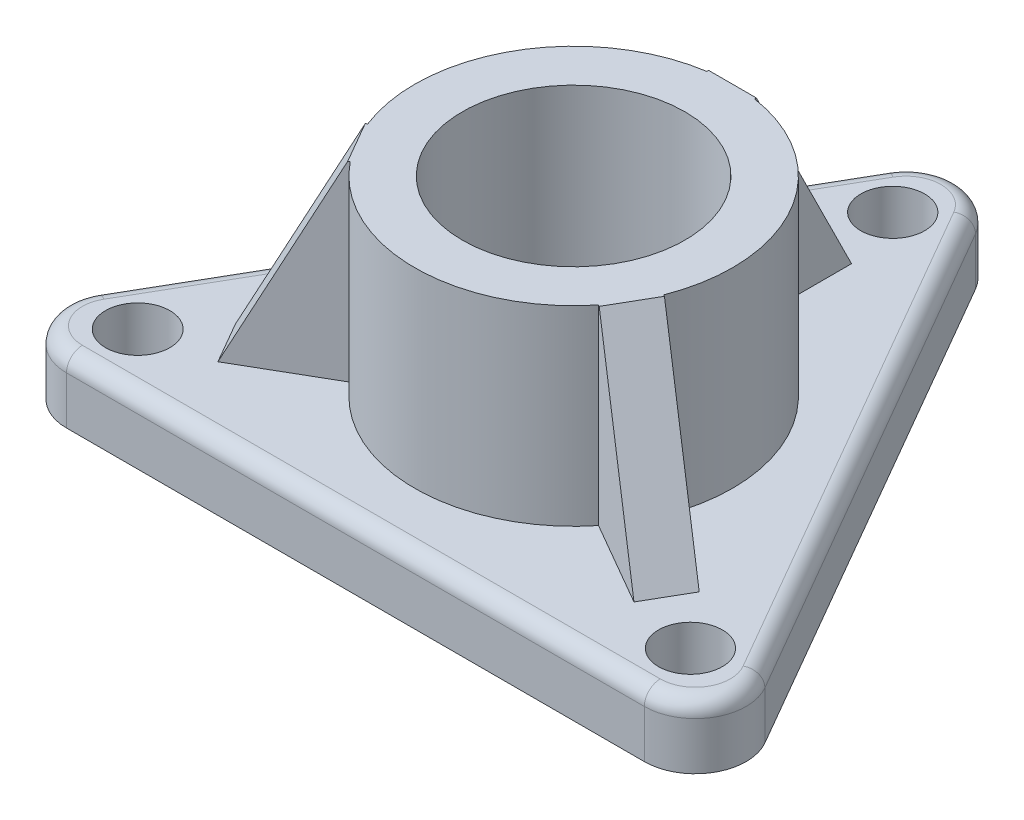
ISO-10303-21;
HEADER;
FILE_DESCRIPTION(('STEP AP214'),'2;1');
FILE_NAME('part.step','',(''),(''),'','','');
FILE_SCHEMA(('AUTOMOTIVE_DESIGN { 1 0 10303 214 1 1 1 1 }'));
ENDSEC;
DATA;
#1=APPLICATION_CONTEXT('core data for automotive mechanical design processes');
#2=APPLICATION_PROTOCOL_DEFINITION('international standard','automotive_design',2000,#1);
#3=PRODUCT_CONTEXT('',#1,'mechanical');
#4=PRODUCT('Part','Part','',(#3));
#5=PRODUCT_RELATED_PRODUCT_CATEGORY('part','',(#4));
#6=PRODUCT_DEFINITION_FORMATION('','',#4);
#7=PRODUCT_DEFINITION_CONTEXT('part definition',#1,'design');
#8=PRODUCT_DEFINITION('design','',#6,#7);
#9=PRODUCT_DEFINITION_SHAPE('','',#8);
#10=(LENGTH_UNIT() NAMED_UNIT(*) SI_UNIT(.MILLI.,.METRE.));
#11=(NAMED_UNIT(*) PLANE_ANGLE_UNIT() SI_UNIT($,.RADIAN.));
#12=(NAMED_UNIT(*) SI_UNIT($,.STERADIAN.) SOLID_ANGLE_UNIT());
#13=UNCERTAINTY_MEASURE_WITH_UNIT(LENGTH_MEASURE(1.E-05),#10,'distance_accuracy_value','');
#14=(GEOMETRIC_REPRESENTATION_CONTEXT(3) GLOBAL_UNCERTAINTY_ASSIGNED_CONTEXT((#13)) GLOBAL_UNIT_ASSIGNED_CONTEXT((#10,
#11,#12)) REPRESENTATION_CONTEXT('',''));
#15=CARTESIAN_POINT('',(0.,0.,0.));
#16=DIRECTION('',(0.,0.,1.));
#17=DIRECTION('',(1.,0.,0.));
#18=AXIS2_PLACEMENT_3D('',#15,#16,#17);
#19=CARTESIAN_POINT('',(0.,50.8,0.));
#20=DIRECTION('',(0.,-1.,0.));
#21=DIRECTION('',(0.,0.,-1.));
#22=AXIS2_PLACEMENT_3D('',#19,#20,#21);
#23=CYLINDRICAL_SURFACE('',#22,31.6964415141576);
#24=DIRECTION('',(0.,-1.,0.));
#25=VECTOR('',#24,1.);
#26=CARTESIAN_POINT('',(4.76249999999957,50.8,-31.3366079595482));
#27=LINE('',#26,#25);
#28=CARTESIAN_POINT('',(4.76249999999957,50.8,-31.3366079595482));
#29=VERTEX_POINT('',#28);
#30=CARTESIAN_POINT('',(4.76249999999957,12.7,-31.3366079595482));
#31=VERTEX_POINT('',#30);
#32=EDGE_CURVE('E197',#29,#31,#27,.T.);
#33=ORIENTED_EDGE('',*,*,#32,.F.);
#34=CARTESIAN_POINT('',(0.,50.8,0.));
#35=DIRECTION('',(0.,1.,0.));
#36=DIRECTION('',(0.,0.,1.));
#37=AXIS2_PLACEMENT_3D('',#34,#35,#36);
#38=CIRCLE('',#37,31.6964415141576);
#39=CARTESIAN_POINT('',(29.5195485614024,50.8,11.5438579942504));
#40=VERTEX_POINT('',#39);
#41=EDGE_CURVE('E314',#40,#29,#38,.T.);
#42=ORIENTED_EDGE('',*,*,#41,.F.);
#43=DIRECTION('',(0.,-1.,0.));
#44=VECTOR('',#43,1.);
#45=CARTESIAN_POINT('',(29.5195485614024,50.8,11.5438579942504));
#46=LINE('',#45,#44);
#47=CARTESIAN_POINT('',(29.5195485614024,12.7,11.5438579942504));
#48=VERTEX_POINT('',#47);
#49=EDGE_CURVE('E258',#40,#48,#46,.T.);
#50=ORIENTED_EDGE('',*,*,#49,.T.);
#51=CARTESIAN_POINT('',(0.,12.7,0.));
#52=DIRECTION('',(0.,1.,0.));
#53=DIRECTION('',(0.,0.,1.));
#54=AXIS2_PLACEMENT_3D('',#51,#52,#53);
#55=CIRCLE('',#54,31.6964415141576);
#56=EDGE_CURVE('E319',#48,#31,#55,.T.);
#57=ORIENTED_EDGE('',*,*,#56,.T.);
#58=EDGE_LOOP('',(#33,#42,#50,#57));
#59=FACE_BOUND('',#58,.T.);
#60=ADVANCED_FACE('F39',(#59),#23,.T.);
#61=DIRECTION('',(0.,-1.,0.));
#62=VECTOR('',#61,1.);
#63=CARTESIAN_POINT('',(24.7570485614025,50.8,19.7927499652972));
#64=LINE('',#63,#62);
#65=CARTESIAN_POINT('',(24.7570485614025,50.8,19.7927499652972));
#66=VERTEX_POINT('',#65);
#67=CARTESIAN_POINT('',(24.7570485614025,12.7,19.7927499652972));
#68=VERTEX_POINT('',#67);
#69=EDGE_CURVE('E248',#66,#68,#64,.T.);
#70=ORIENTED_EDGE('',*,*,#69,.F.);
#71=CARTESIAN_POINT('',(-24.7570485614022,50.8,19.7927499652976));
#72=VERTEX_POINT('',#71);
#73=EDGE_CURVE('E309',#72,#66,#38,.T.);
#74=ORIENTED_EDGE('',*,*,#73,.F.);
#75=DIRECTION('',(0.,-1.,0.));
#76=VECTOR('',#75,1.);
#77=CARTESIAN_POINT('',(-24.7570485614022,50.8,19.7927499652976));
#78=LINE('',#77,#76);
#79=CARTESIAN_POINT('',(-24.7570485614022,12.7,19.7927499652976));
#80=VERTEX_POINT('',#79);
#81=EDGE_CURVE('E273',#72,#80,#78,.T.);
#82=ORIENTED_EDGE('',*,*,#81,.T.);
#83=EDGE_CURVE('E316',#80,#68,#55,.T.);
#84=ORIENTED_EDGE('',*,*,#83,.T.);
#85=EDGE_LOOP('',(#70,#74,#82,#84));
#86=FACE_BOUND('',#85,.T.);
#87=ADVANCED_FACE('F502',(#86),#23,.T.);
#88=CARTESIAN_POINT('',(0.,12.7,0.));
#89=DIRECTION('',(0.,1.,0.));
#90=DIRECTION('',(0.,0.,1.));
#91=AXIS2_PLACEMENT_3D('',#88,#89,#90);
#92=PLANE('',#91);
#93=DIRECTION('',(0.,0.,1.));
#94=VECTOR('',#93,1.);
#95=CARTESIAN_POINT('',(-4.76249999999999,12.7,0.));
#96=LINE('',#95,#94);
#97=CARTESIAN_POINT('',(-4.7625000000007,12.7,-50.6555311390038));
#98=VERTEX_POINT('',#97);
#99=CARTESIAN_POINT('',(-4.76250000000043,12.7,-31.3366079595481));
#100=VERTEX_POINT('',#99);
#101=EDGE_CURVE('E57',#98,#100,#96,.T.);
#102=ORIENTED_EDGE('',*,*,#101,.F.);
#103=DIRECTION('',(1.,0.,0.));
#104=VECTOR('',#103,1.);
#105=CARTESIAN_POINT('',(-4.7625000000007,12.7,-50.6555311390038));
#106=LINE('',#105,#104);
#107=CARTESIAN_POINT('',(4.7624999999993,12.7,-50.6555311389984));
#108=VERTEX_POINT('',#107);
#109=EDGE_CURVE('E61',#98,#108,#106,.T.);
#110=ORIENTED_EDGE('',*,*,#109,.T.);
#111=DIRECTION('',(0.,0.,1.));
#112=VECTOR('',#111,1.);
#113=CARTESIAN_POINT('',(4.76250000000001,12.7,0.));
#114=LINE('',#113,#112);
#115=EDGE_CURVE('E221',#108,#31,#114,.T.);
#116=ORIENTED_EDGE('',*,*,#115,.T.);
#117=ORIENTED_EDGE('',*,*,#56,.F.);
#118=DIRECTION('',(-0.866025403784443,0.,-0.499999999999992));
#119=VECTOR('',#118,1.);
#120=CARTESIAN_POINT('',(2.38124999999996,12.7,-4.1244459855234));
#121=LINE('',#120,#119);
#122=CARTESIAN_POINT('',(46.2502268085712,12.7,21.2033195839781));
#123=VERTEX_POINT('',#122);
#124=EDGE_CURVE('E261',#123,#48,#121,.T.);
#125=ORIENTED_EDGE('',*,*,#124,.F.);
#126=DIRECTION('',(-0.499999999999992,0.,0.866025403784443));
#127=VECTOR('',#126,1.);
#128=CARTESIAN_POINT('',(46.2502268085712,12.7,21.2033195839781));
#129=LINE('',#128,#127);
#130=CARTESIAN_POINT('',(41.4877268085665,12.7,29.4522115550222));
#131=VERTEX_POINT('',#130);
#132=EDGE_CURVE('E238',#123,#131,#129,.T.);
#133=ORIENTED_EDGE('',*,*,#132,.T.);
#134=DIRECTION('',(-0.866025403784443,0.,-0.499999999999992));
#135=VECTOR('',#134,1.);
#136=CARTESIAN_POINT('',(-2.38124999999997,12.7,4.12444598552342));
#137=LINE('',#136,#135);
#138=EDGE_CURVE('E254',#131,#68,#137,.T.);
#139=ORIENTED_EDGE('',*,*,#138,.T.);
#140=ORIENTED_EDGE('',*,*,#83,.F.);
#141=DIRECTION('',(0.866025403784436,0.,-0.500000000000004));
#142=VECTOR('',#141,1.);
#143=CARTESIAN_POINT('',(2.38125000000002,12.7,4.12444598552337));
#144=LINE('',#143,#142);
#145=CARTESIAN_POINT('',(-41.4877268085709,12.7,29.4522115550255));
#146=VERTEX_POINT('',#145);
#147=EDGE_CURVE('E277',#146,#80,#144,.T.);
#148=ORIENTED_EDGE('',*,*,#147,.F.);
#149=DIRECTION('',(0.500000000000004,0.,0.866025403784436));
#150=VECTOR('',#149,1.);
#151=CARTESIAN_POINT('',(-46.2502268085709,12.7,21.2033195839787));
#152=LINE('',#151,#150);
#153=CARTESIAN_POINT('',(-46.2502268085709,12.7,21.2033195839787));
#154=VERTEX_POINT('',#153);
#155=EDGE_CURVE('E293',#154,#146,#152,.T.);
#156=ORIENTED_EDGE('',*,*,#155,.F.);
#157=DIRECTION('',(-0.866025403784436,0.,0.500000000000004));
#158=VECTOR('',#157,1.);
#159=CARTESIAN_POINT('',(-26.687894357597,12.7,9.90900167743188));
#160=LINE('',#159,#158);
#161=CARTESIAN_POINT('',(-29.5195485614023,12.7,11.5438579942508));
#162=VERTEX_POINT('',#161);
#163=EDGE_CURVE('E280',#162,#154,#160,.T.);
#164=ORIENTED_EDGE('',*,*,#163,.F.);
#165=EDGE_CURVE('E305',#100,#162,#55,.T.);
#166=ORIENTED_EDGE('',*,*,#165,.F.);
#167=EDGE_LOOP('',(#102,#110,#116,#117,#125,#133,#139,#140,#148,#156,#164,#166));
#168=FACE_BOUND('',#167,.T.);
#169=DIRECTION('',(-0.500000000000004,0.,-0.866025403784436));
#170=VECTOR('',#169,1.);
#171=CARTESIAN_POINT('',(6.04918744543435,12.7,-69.7644196864919));
#172=LINE('',#171,#170);
#173=CARTESIAN_POINT('',(63.4423534514986,12.7,29.6434598432453));
#174=VERTEX_POINT('',#173);
#175=CARTESIAN_POINT('',(6.04918744543436,12.7,-69.7644196864919));
#176=VERTEX_POINT('',#175);
#177=EDGE_CURVE('E398',#174,#176,#172,.T.);
#178=ORIENTED_EDGE('',*,*,#177,.T.);
#179=CARTESIAN_POINT('',(0.,12.7,-66.2719196864918));
#180=DIRECTION('',(0.,1.,0.));
#181=DIRECTION('',(0.,0.,1.));
#182=AXIS2_PLACEMENT_3D('',#179,#180,#181);
#183=CIRCLE('',#182,6.985);
#184=CARTESIAN_POINT('',(-6.04918744543424,12.7,-69.7644196864918));
#185=VERTEX_POINT('',#184);
#186=EDGE_CURVE('E401',#176,#185,#183,.T.);
#187=ORIENTED_EDGE('',*,*,#186,.T.);
#188=DIRECTION('',(-0.499999999999998,0.,0.86602540378444));
#189=VECTOR('',#188,1.);
#190=CARTESIAN_POINT('',(-63.6623239040593,12.7,30.0244598432462));
#191=LINE('',#190,#189);
#192=CARTESIAN_POINT('',(-63.6623239040593,12.7,30.0244598432462));
#193=VERTEX_POINT('',#192);
#194=EDGE_CURVE('E395',#185,#193,#191,.T.);
#195=ORIENTED_EDGE('',*,*,#194,.T.);
#196=CARTESIAN_POINT('',(-57.8331069111862,12.7,33.3899598432461));
#197=DIRECTION('',(0.,1.,0.));
#198=DIRECTION('',(0.,0.,1.));
#199=AXIS2_PLACEMENT_3D('',#196,#197,#198);
#200=CIRCLE('',#199,6.731);
#201=CARTESIAN_POINT('',(-57.8331069111862,12.7,40.1209598432461));
#202=VERTEX_POINT('',#201);
#203=EDGE_CURVE('E392',#193,#202,#200,.T.);
#204=ORIENTED_EDGE('',*,*,#203,.T.);
#205=DIRECTION('',(1.,0.,0.));
#206=VECTOR('',#205,1.);
#207=CARTESIAN_POINT('',(57.3931660060643,12.7,40.1209598432453));
#208=LINE('',#207,#206);
#209=CARTESIAN_POINT('',(57.3931660060643,12.7,40.1209598432453));
#210=VERTEX_POINT('',#209);
#211=EDGE_CURVE('E389',#202,#210,#208,.T.);
#212=ORIENTED_EDGE('',*,*,#211,.T.);
#213=CARTESIAN_POINT('',(57.3931660060643,12.7,33.1359598432453));
#214=DIRECTION('',(0.,1.,0.));
#215=DIRECTION('',(0.,0.,1.));
#216=AXIS2_PLACEMENT_3D('',#213,#214,#215);
#217=CIRCLE('',#216,6.985);
#218=EDGE_CURVE('E386',#210,#174,#217,.T.);
#219=ORIENTED_EDGE('',*,*,#218,.T.);
#220=EDGE_LOOP('',(#178,#187,#195,#204,#212,#219));
#221=FACE_BOUND('',#220,.T.);
#222=CARTESIAN_POINT('',(55.1128235736849,12.7,31.8194035260667));
#223=DIRECTION('',(0.,1.,0.));
#224=DIRECTION('',(0.,0.,1.));
#225=AXIS2_PLACEMENT_3D('',#222,#223,#224);
#226=CIRCLE('',#225,6.3644014156127);
#227=CARTESIAN_POINT('',(55.1128235736849,12.7,38.1838049416794));
#228=VERTEX_POINT('',#227);
#229=EDGE_CURVE('E329',#228,#228,#226,.T.);
#230=ORIENTED_EDGE('',*,*,#229,.F.);
#231=EDGE_LOOP('',(#230));
#232=FACE_BOUND('',#231,.T.);
#233=CARTESIAN_POINT('',(3.80888941584997E-12,12.7,-63.6388070520337));
#234=DIRECTION('',(0.,1.,0.));
#235=DIRECTION('',(0.,0.,1.));
#236=AXIS2_PLACEMENT_3D('',#233,#234,#235);
#237=CIRCLE('',#236,6.36947411317297);
#238=CARTESIAN_POINT('',(3.80888941584997E-12,12.7,-57.2693329388607));
#239=VERTEX_POINT('',#238);
#240=EDGE_CURVE('E337',#239,#239,#237,.T.);
#241=ORIENTED_EDGE('',*,*,#240,.F.);
#242=EDGE_LOOP('',(#241));
#243=FACE_BOUND('',#242,.T.);
#244=CARTESIAN_POINT('',(-55.1128235735971,12.7,31.819403526017));
#245=DIRECTION('',(0.,1.,0.));
#246=DIRECTION('',(0.,0.,1.));
#247=AXIS2_PLACEMENT_3D('',#244,#245,#246);
#248=CIRCLE('',#247,6.41322557330258);
#249=CARTESIAN_POINT('',(-55.1128235735971,12.7,38.2326290993196));
#250=VERTEX_POINT('',#249);
#251=EDGE_CURVE('E320',#250,#250,#248,.T.);
#252=ORIENTED_EDGE('',*,*,#251,.F.);
#253=EDGE_LOOP('',(#252));
#254=FACE_BOUND('',#253,.T.);
#255=ADVANCED_FACE('F491',(#168,#221,#232,#243,#254),#92,.T.);
#256=CARTESIAN_POINT('',(-4.76250000000043,50.8,-31.3366079595481));
#257=VERTEX_POINT('',#256);
#258=CARTESIAN_POINT('',(-29.5195485614023,50.8,11.5438579942508));
#259=VERTEX_POINT('',#258);
#260=EDGE_CURVE('E315',#257,#259,#38,.T.);
#261=ORIENTED_EDGE('',*,*,#260,.F.);
#262=DIRECTION('',(0.,-1.,0.));
#263=VECTOR('',#262,1.);
#264=CARTESIAN_POINT('',(-4.76250000000043,50.8,-31.336607959548));
#265=LINE('',#264,#263);
#266=EDGE_CURVE('E204',#257,#100,#265,.T.);
#267=ORIENTED_EDGE('',*,*,#266,.T.);
#268=ORIENTED_EDGE('',*,*,#165,.T.);
#269=DIRECTION('',(0.,-1.,0.));
#270=VECTOR('',#269,1.);
#271=CARTESIAN_POINT('',(-29.5195485614023,50.8,11.5438579942508));
#272=LINE('',#271,#270);
#273=EDGE_CURVE('E296',#259,#162,#272,.T.);
#274=ORIENTED_EDGE('',*,*,#273,.F.);
#275=EDGE_LOOP('',(#261,#267,#268,#274));
#276=FACE_BOUND('',#275,.T.);
#277=ADVANCED_FACE('F505',(#276),#23,.T.);
#278=CARTESIAN_POINT('',(0.,0.,0.));
#279=DIRECTION('',(0.,1.,0.));
#280=DIRECTION('',(0.,0.,1.));
#281=AXIS2_PLACEMENT_3D('',#278,#279,#280);
#282=PLANE('',#281);
#283=DIRECTION('',(-0.499999999999998,0.,0.86602540378444));
#284=VECTOR('',#283,1.);
#285=CARTESIAN_POINT('',(0.,0.,-86.5919196864918));
#286=LINE('',#285,#284);
#287=CARTESIAN_POINT('',(-8.79881810244984,0.,-71.3519196864918));
#288=VERTEX_POINT('',#287);
#289=CARTESIAN_POINT('',(-66.4119545610749,0.,28.4369598432462));
#290=VERTEX_POINT('',#289);
#291=EDGE_CURVE('E348',#288,#290,#286,.T.);
#292=ORIENTED_EDGE('',*,*,#291,.F.);
#293=CARTESIAN_POINT('',(0.,0.,-66.2719196864918));
#294=DIRECTION('',(0.,1.,0.));
#295=DIRECTION('',(0.,0.,1.));
#296=AXIS2_PLACEMENT_3D('',#293,#294,#295);
#297=CIRCLE('',#296,10.16);
#298=CARTESIAN_POINT('',(8.79881810244995,0.,-71.3519196864919));
#299=VERTEX_POINT('',#298);
#300=EDGE_CURVE('E379',#288,#299,#297,.F.);
#301=ORIENTED_EDGE('',*,*,#300,.T.);
#302=DIRECTION('',(-0.500000000000004,0.,-0.866025403784436));
#303=VECTOR('',#302,1.);
#304=CARTESIAN_POINT('',(74.9908022109641,0.,43.2959598432452));
#305=LINE('',#304,#303);
#306=CARTESIAN_POINT('',(66.1919841085142,0.,28.0559598432453));
#307=VERTEX_POINT('',#306);
#308=EDGE_CURVE('E341',#307,#299,#305,.T.);
#309=ORIENTED_EDGE('',*,*,#308,.F.);
#310=CARTESIAN_POINT('',(57.3931660060643,0.,33.1359598432453));
#311=DIRECTION('',(0.,1.,0.));
#312=DIRECTION('',(0.,0.,1.));
#313=AXIS2_PLACEMENT_3D('',#310,#311,#312);
#314=CIRCLE('',#313,10.16);
#315=CARTESIAN_POINT('',(57.3931660060644,0.,43.2959598432453));
#316=VERTEX_POINT('',#315);
#317=EDGE_CURVE('E369',#307,#316,#314,.F.);
#318=ORIENTED_EDGE('',*,*,#317,.T.);
#319=DIRECTION('',(1.,0.,0.));
#320=VECTOR('',#319,1.);
#321=CARTESIAN_POINT('',(-74.9908022109636,0.,43.2959598432462));
#322=LINE('',#321,#320);
#323=CARTESIAN_POINT('',(-57.8331069111862,0.,43.2959598432461));
#324=VERTEX_POINT('',#323);
#325=EDGE_CURVE('E351',#324,#316,#322,.T.);
#326=ORIENTED_EDGE('',*,*,#325,.F.);
#327=CARTESIAN_POINT('',(-57.8331069111862,0.,33.3899598432461));
#328=DIRECTION('',(0.,1.,0.));
#329=DIRECTION('',(0.,0.,1.));
#330=AXIS2_PLACEMENT_3D('',#327,#328,#329);
#331=CIRCLE('',#330,9.906);
#332=EDGE_CURVE('E358',#324,#290,#331,.F.);
#333=ORIENTED_EDGE('',*,*,#332,.T.);
#334=EDGE_LOOP('',(#292,#301,#309,#318,#326,#333));
#335=FACE_BOUND('',#334,.T.);
#336=CARTESIAN_POINT('',(3.80888941584997E-12,0.,-63.6388070520337));
#337=DIRECTION('',(0.,1.,0.));
#338=DIRECTION('',(0.,0.,1.));
#339=AXIS2_PLACEMENT_3D('',#336,#337,#338);
#340=CIRCLE('',#339,6.36947411317297);
#341=CARTESIAN_POINT('',(3.80888941584997E-12,0.,-57.2693329388607));
#342=VERTEX_POINT('',#341);
#343=EDGE_CURVE('E333',#342,#342,#340,.T.);
#344=ORIENTED_EDGE('',*,*,#343,.T.);
#345=EDGE_LOOP('',(#344));
#346=FACE_BOUND('',#345,.T.);
#347=CARTESIAN_POINT('',(55.1128235736849,0.,31.8194035260667));
#348=DIRECTION('',(0.,1.,0.));
#349=DIRECTION('',(0.,0.,1.));
#350=AXIS2_PLACEMENT_3D('',#347,#348,#349);
#351=CIRCLE('',#350,6.3644014156127);
#352=CARTESIAN_POINT('',(55.1128235736849,0.,38.1838049416794));
#353=VERTEX_POINT('',#352);
#354=EDGE_CURVE('E324',#353,#353,#351,.T.);
#355=ORIENTED_EDGE('',*,*,#354,.T.);
#356=EDGE_LOOP('',(#355));
#357=FACE_BOUND('',#356,.T.);
#358=CARTESIAN_POINT('',(-55.1128235735971,0.,31.819403526017));
#359=DIRECTION('',(0.,1.,0.));
#360=DIRECTION('',(0.,0.,1.));
#361=AXIS2_PLACEMENT_3D('',#358,#359,#360);
#362=CIRCLE('',#361,6.41322557330258);
#363=CARTESIAN_POINT('',(-55.1128235735971,0.,38.2326290993196));
#364=VERTEX_POINT('',#363);
#365=EDGE_CURVE('E325',#364,#364,#362,.T.);
#366=ORIENTED_EDGE('',*,*,#365,.T.);
#367=EDGE_LOOP('',(#366));
#368=FACE_BOUND('',#367,.T.);
#369=ADVANCED_FACE('F461',(#335,#346,#357,#368),#282,.F.);
#370=CARTESIAN_POINT('',(74.9908022109641,12.7,43.2959598432452));
#371=DIRECTION('',(-0.866025403784436,0.,0.500000000000004));
#372=DIRECTION('',(0.500000000000004,0.,0.866025403784436));
#373=AXIS2_PLACEMENT_3D('',#370,#371,#372);
#374=PLANE('',#373);
#375=DIRECTION('',(0.,-1.,0.));
#376=VECTOR('',#375,1.);
#377=CARTESIAN_POINT('',(8.79881810244994,12.7,-71.3519196864919));
#378=LINE('',#377,#376);
#379=CARTESIAN_POINT('',(8.79881810244994,9.525,-71.3519196864919));
#380=VERTEX_POINT('',#379);
#381=EDGE_CURVE('E382',#299,#380,#378,.F.);
#382=ORIENTED_EDGE('',*,*,#381,.T.);
#383=DIRECTION('',(-0.500000000000004,0.,-0.866025403784436));
#384=VECTOR('',#383,1.);
#385=CARTESIAN_POINT('',(66.1919841085142,9.525,28.0559598432453));
#386=LINE('',#385,#384);
#387=CARTESIAN_POINT('',(66.1919841085142,9.525,28.0559598432453));
#388=VERTEX_POINT('',#387);
#389=EDGE_CURVE('E409',#380,#388,#386,.F.);
#390=ORIENTED_EDGE('',*,*,#389,.T.);
#391=DIRECTION('',(0.,-1.,0.));
#392=VECTOR('',#391,1.);
#393=CARTESIAN_POINT('',(66.1919841085142,12.7,28.0559598432453));
#394=LINE('',#393,#392);
#395=EDGE_CURVE('E366',#388,#307,#394,.T.);
#396=ORIENTED_EDGE('',*,*,#395,.T.);
#397=ORIENTED_EDGE('',*,*,#308,.T.);
#398=EDGE_LOOP('',(#382,#390,#396,#397));
#399=FACE_BOUND('',#398,.T.);
#400=ADVANCED_FACE('F469',(#399),#374,.F.);
#401=CARTESIAN_POINT('',(0.,12.7,-86.5919196864918));
#402=DIRECTION('',(0.86602540378444,0.,0.499999999999998));
#403=DIRECTION('',(0.499999999999998,0.,-0.86602540378444));
#404=AXIS2_PLACEMENT_3D('',#401,#402,#403);
#405=PLANE('',#404);
#406=DIRECTION('',(0.,-1.,0.));
#407=VECTOR('',#406,1.);
#408=CARTESIAN_POINT('',(-66.4119545610749,12.7,28.4369598432462));
#409=LINE('',#408,#407);
#410=CARTESIAN_POINT('',(-66.4119545610749,9.525,28.4369598432462));
#411=VERTEX_POINT('',#410);
#412=EDGE_CURVE('E362',#290,#411,#409,.F.);
#413=ORIENTED_EDGE('',*,*,#412,.T.);
#414=DIRECTION('',(-0.499999999999998,0.,0.86602540378444));
#415=VECTOR('',#414,1.);
#416=CARTESIAN_POINT('',(-8.79881810244983,9.525,-71.3519196864918));
#417=LINE('',#416,#415);
#418=CARTESIAN_POINT('',(-8.79881810244984,9.525,-71.3519196864918));
#419=VERTEX_POINT('',#418);
#420=EDGE_CURVE('E412',#411,#419,#417,.F.);
#421=ORIENTED_EDGE('',*,*,#420,.T.);
#422=DIRECTION('',(0.,-1.,0.));
#423=VECTOR('',#422,1.);
#424=CARTESIAN_POINT('',(-8.79881810244984,12.7,-71.3519196864918));
#425=LINE('',#424,#423);
#426=EDGE_CURVE('E376',#419,#288,#425,.T.);
#427=ORIENTED_EDGE('',*,*,#426,.T.);
#428=ORIENTED_EDGE('',*,*,#291,.T.);
#429=EDGE_LOOP('',(#413,#421,#427,#428));
#430=FACE_BOUND('',#429,.T.);
#431=ADVANCED_FACE('F591',(#430),#405,.F.);
#432=CARTESIAN_POINT('',(-74.9908022109636,12.7,43.2959598432462));
#433=DIRECTION('',(0.,0.,-1.));
#434=DIRECTION('',(-1.,0.,0.));
#435=AXIS2_PLACEMENT_3D('',#432,#433,#434);
#436=PLANE('',#435);
#437=DIRECTION('',(0.,-1.,0.));
#438=VECTOR('',#437,1.);
#439=CARTESIAN_POINT('',(57.3931660060644,12.7,43.2959598432453));
#440=LINE('',#439,#438);
#441=CARTESIAN_POINT('',(57.3931660060644,9.525,43.2959598432453));
#442=VERTEX_POINT('',#441);
#443=EDGE_CURVE('E372',#316,#442,#440,.F.);
#444=ORIENTED_EDGE('',*,*,#443,.T.);
#445=DIRECTION('',(1.,0.,0.));
#446=VECTOR('',#445,1.);
#447=CARTESIAN_POINT('',(-57.8331069111862,9.525,43.2959598432461));
#448=LINE('',#447,#446);
#449=CARTESIAN_POINT('',(-57.8331069111862,9.525,43.2959598432461));
#450=VERTEX_POINT('',#449);
#451=EDGE_CURVE('E49',#442,#450,#448,.F.);
#452=ORIENTED_EDGE('',*,*,#451,.T.);
#453=DIRECTION('',(0.,-1.,0.));
#454=VECTOR('',#453,1.);
#455=CARTESIAN_POINT('',(-57.8331069111862,12.7,43.2959598432461));
#456=LINE('',#455,#454);
#457=EDGE_CURVE('E355',#450,#324,#456,.T.);
#458=ORIENTED_EDGE('',*,*,#457,.T.);
#459=ORIENTED_EDGE('',*,*,#325,.T.);
#460=EDGE_LOOP('',(#444,#452,#458,#459));
#461=FACE_BOUND('',#460,.T.);
#462=ADVANCED_FACE('F452',(#461),#436,.F.);
#463=CARTESIAN_POINT('',(3.80888941584997E-12,12.7,-63.6388070520337));
#464=DIRECTION('',(0.,-1.,0.));
#465=DIRECTION('',(0.,0.,-1.));
#466=AXIS2_PLACEMENT_3D('',#463,#464,#465);
#467=CYLINDRICAL_SURFACE('',#466,6.36947411317297);
#468=ORIENTED_EDGE('',*,*,#240,.T.);
#469=EDGE_LOOP('',(#468));
#470=FACE_BOUND('',#469,.T.);
#471=ORIENTED_EDGE('',*,*,#343,.F.);
#472=EDGE_LOOP('',(#471));
#473=FACE_BOUND('',#472,.T.);
#474=ADVANCED_FACE('F596',(#470,#473),#467,.F.);
#475=CARTESIAN_POINT('',(55.1128235736849,12.7,31.8194035260667));
#476=DIRECTION('',(0.,-1.,0.));
#477=DIRECTION('',(0.,0.,-1.));
#478=AXIS2_PLACEMENT_3D('',#475,#476,#477);
#479=CYLINDRICAL_SURFACE('',#478,6.3644014156127);
#480=ORIENTED_EDGE('',*,*,#229,.T.);
#481=EDGE_LOOP('',(#480));
#482=FACE_BOUND('',#481,.T.);
#483=ORIENTED_EDGE('',*,*,#354,.F.);
#484=EDGE_LOOP('',(#483));
#485=FACE_BOUND('',#484,.T.);
#486=ADVANCED_FACE('F600',(#482,#485),#479,.F.);
#487=CARTESIAN_POINT('',(-55.1128235735971,12.7,31.819403526017));
#488=DIRECTION('',(0.,-1.,0.));
#489=DIRECTION('',(0.,0.,-1.));
#490=AXIS2_PLACEMENT_3D('',#487,#488,#489);
#491=CYLINDRICAL_SURFACE('',#490,6.41322557330258);
#492=ORIENTED_EDGE('',*,*,#251,.T.);
#493=EDGE_LOOP('',(#492));
#494=FACE_BOUND('',#493,.T.);
#495=ORIENTED_EDGE('',*,*,#365,.F.);
#496=EDGE_LOOP('',(#495));
#497=FACE_BOUND('',#496,.T.);
#498=ADVANCED_FACE('F588',(#494,#497),#491,.F.);
#499=CARTESIAN_POINT('',(-57.8331069111862,12.7,33.3899598432461));
#500=DIRECTION('',(0.,-1.,0.));
#501=DIRECTION('',(0.,0.,-1.));
#502=AXIS2_PLACEMENT_3D('',#499,#500,#501);
#503=CYLINDRICAL_SURFACE('',#502,9.906);
#504=ORIENTED_EDGE('',*,*,#457,.F.);
#505=CARTESIAN_POINT('',(-57.8331069111862,9.525,33.3899598432461));
#506=DIRECTION('',(0.,1.,0.));
#507=DIRECTION('',(0.,0.,1.));
#508=AXIS2_PLACEMENT_3D('',#505,#506,#507);
#509=CIRCLE('',#508,9.906);
#510=EDGE_CURVE('E415',#450,#411,#509,.F.);
#511=ORIENTED_EDGE('',*,*,#510,.T.);
#512=ORIENTED_EDGE('',*,*,#412,.F.);
#513=ORIENTED_EDGE('',*,*,#332,.F.);
#514=EDGE_LOOP('',(#504,#511,#512,#513));
#515=FACE_BOUND('',#514,.T.);
#516=ADVANCED_FACE('F456',(#515),#503,.T.);
#517=CARTESIAN_POINT('',(57.3931660060643,12.7,33.1359598432453));
#518=DIRECTION('',(0.,-1.,0.));
#519=DIRECTION('',(0.,0.,-1.));
#520=AXIS2_PLACEMENT_3D('',#517,#518,#519);
#521=CYLINDRICAL_SURFACE('',#520,10.16);
#522=ORIENTED_EDGE('',*,*,#395,.F.);
#523=CARTESIAN_POINT('',(57.3931660060643,9.525,33.1359598432453));
#524=DIRECTION('',(0.,1.,0.));
#525=DIRECTION('',(0.,0.,1.));
#526=AXIS2_PLACEMENT_3D('',#523,#524,#525);
#527=CIRCLE('',#526,10.16);
#528=EDGE_CURVE('E11',#388,#442,#527,.F.);
#529=ORIENTED_EDGE('',*,*,#528,.T.);
#530=ORIENTED_EDGE('',*,*,#443,.F.);
#531=ORIENTED_EDGE('',*,*,#317,.F.);
#532=EDGE_LOOP('',(#522,#529,#530,#531));
#533=FACE_BOUND('',#532,.T.);
#534=ADVANCED_FACE('F467',(#533),#521,.T.);
#535=CARTESIAN_POINT('',(0.,12.7,-66.2719196864918));
#536=DIRECTION('',(0.,-1.,0.));
#537=DIRECTION('',(0.,0.,-1.));
#538=AXIS2_PLACEMENT_3D('',#535,#536,#537);
#539=CYLINDRICAL_SURFACE('',#538,10.16);
#540=ORIENTED_EDGE('',*,*,#426,.F.);
#541=CARTESIAN_POINT('',(0.,9.525,-66.2719196864918));
#542=DIRECTION('',(0.,1.,0.));
#543=DIRECTION('',(0.,0.,1.));
#544=AXIS2_PLACEMENT_3D('',#541,#542,#543);
#545=CIRCLE('',#544,10.16);
#546=EDGE_CURVE('E405',#419,#380,#545,.F.);
#547=ORIENTED_EDGE('',*,*,#546,.T.);
#548=ORIENTED_EDGE('',*,*,#381,.F.);
#549=ORIENTED_EDGE('',*,*,#300,.F.);
#550=EDGE_LOOP('',(#540,#547,#548,#549));
#551=FACE_BOUND('',#550,.T.);
#552=ADVANCED_FACE('F480',(#551),#539,.T.);
#553=CARTESIAN_POINT('',(2.76573034589706E-13,9.525,40.1209598432457));
#554=DIRECTION('',(-1.,0.,0.));
#555=DIRECTION('',(0.,0.,1.));
#556=AXIS2_PLACEMENT_3D('',#553,#554,#555);
#557=CYLINDRICAL_SURFACE('',#556,3.175);
#558=CARTESIAN_POINT('',(-57.8331069111862,9.525,40.1209598432461));
#559=DIRECTION('',(-1.,0.,0.));
#560=DIRECTION('',(0.,0.,1.));
#561=AXIS2_PLACEMENT_3D('',#558,#559,#560);
#562=CIRCLE('',#561,3.175);
#563=EDGE_CURVE('E432',#450,#202,#562,.T.);
#564=ORIENTED_EDGE('',*,*,#563,.F.);
#565=ORIENTED_EDGE('',*,*,#451,.F.);
#566=CARTESIAN_POINT('',(57.3931660060643,9.525,40.1209598432453));
#567=DIRECTION('',(1.,0.,0.));
#568=DIRECTION('',(0.,0.,-1.));
#569=AXIS2_PLACEMENT_3D('',#566,#567,#568);
#570=CIRCLE('',#569,3.175);
#571=EDGE_CURVE('E43',#210,#442,#570,.T.);
#572=ORIENTED_EDGE('',*,*,#571,.F.);
#573=ORIENTED_EDGE('',*,*,#211,.F.);
#574=EDGE_LOOP('',(#564,#565,#572,#573));
#575=FACE_BOUND('',#574,.T.);
#576=ADVANCED_FACE('F41',(#575),#557,.T.);
#577=CARTESIAN_POINT('',(57.3931660060643,9.525,33.1359598432453));
#578=DIRECTION('',(0.,1.,0.));
#579=DIRECTION('',(0.,0.,1.));
#580=AXIS2_PLACEMENT_3D('',#577,#578,#579);
#581=TOROIDAL_SURFACE('',#580,6.985,3.175);
#582=ORIENTED_EDGE('',*,*,#571,.T.);
#583=ORIENTED_EDGE('',*,*,#528,.F.);
#584=CARTESIAN_POINT('',(63.4423534514986,9.525,29.6434598432453));
#585=DIRECTION('',(-0.500000000000006,0.,-0.866025403784435));
#586=DIRECTION('',(-0.866025403784435,0.,0.500000000000006));
#587=AXIS2_PLACEMENT_3D('',#584,#585,#586);
#588=CIRCLE('',#587,3.175);
#589=EDGE_CURVE('E429',#174,#388,#588,.T.);
#590=ORIENTED_EDGE('',*,*,#589,.F.);
#591=ORIENTED_EDGE('',*,*,#218,.F.);
#592=EDGE_LOOP('',(#582,#583,#590,#591));
#593=FACE_BOUND('',#592,.T.);
#594=ADVANCED_FACE('F445',(#593),#581,.T.);
#595=CARTESIAN_POINT('',(-57.8331069111862,9.525,33.3899598432461));
#596=DIRECTION('',(0.,1.,0.));
#597=DIRECTION('',(0.,0.,1.));
#598=AXIS2_PLACEMENT_3D('',#595,#596,#597);
#599=TOROIDAL_SURFACE('',#598,6.731,3.175);
#600=ORIENTED_EDGE('',*,*,#563,.T.);
#601=ORIENTED_EDGE('',*,*,#203,.F.);
#602=CARTESIAN_POINT('',(-63.6623239040593,9.525,30.0244598432461));
#603=DIRECTION('',(0.499999999999996,0.,-0.866025403784441));
#604=DIRECTION('',(-0.866025403784441,0.,-0.499999999999996));
#605=AXIS2_PLACEMENT_3D('',#602,#603,#604);
#606=CIRCLE('',#605,3.175);
#607=EDGE_CURVE('E425',#411,#193,#606,.T.);
#608=ORIENTED_EDGE('',*,*,#607,.F.);
#609=ORIENTED_EDGE('',*,*,#510,.F.);
#610=EDGE_LOOP('',(#600,#601,#608,#609));
#611=FACE_BOUND('',#610,.T.);
#612=ADVANCED_FACE('F493',(#611),#599,.T.);
#613=CARTESIAN_POINT('',(34.7457704484665,9.525,-20.0604799216233));
#614=DIRECTION('',(0.500000000000004,0.,0.866025403784436));
#615=DIRECTION('',(0.866025403784436,0.,-0.500000000000004));
#616=AXIS2_PLACEMENT_3D('',#613,#614,#615);
#617=CYLINDRICAL_SURFACE('',#616,3.175);
#618=ORIENTED_EDGE('',*,*,#589,.T.);
#619=ORIENTED_EDGE('',*,*,#389,.F.);
#620=CARTESIAN_POINT('',(6.04918744543436,9.525,-69.7644196864919));
#621=DIRECTION('',(-0.500000000000005,0.,-0.866025403784436));
#622=DIRECTION('',(-0.866025403784436,0.,0.500000000000005));
#623=AXIS2_PLACEMENT_3D('',#620,#621,#622);
#624=CIRCLE('',#623,3.175);
#625=EDGE_CURVE('E422',#176,#380,#624,.T.);
#626=ORIENTED_EDGE('',*,*,#625,.F.);
#627=ORIENTED_EDGE('',*,*,#177,.F.);
#628=EDGE_LOOP('',(#618,#619,#626,#627));
#629=FACE_BOUND('',#628,.T.);
#630=ADVANCED_FACE('F474',(#629),#617,.T.);
#631=CARTESIAN_POINT('',(-34.7457704484662,9.525,-20.0604799216228));
#632=DIRECTION('',(0.499999999999998,0.,-0.86602540378444));
#633=DIRECTION('',(-0.86602540378444,0.,-0.499999999999998));
#634=AXIS2_PLACEMENT_3D('',#631,#632,#633);
#635=CYLINDRICAL_SURFACE('',#634,3.175);
#636=ORIENTED_EDGE('',*,*,#607,.T.);
#637=ORIENTED_EDGE('',*,*,#194,.F.);
#638=CARTESIAN_POINT('',(-6.04918744543424,9.525,-69.7644196864918));
#639=DIRECTION('',(0.499999999999998,0.,-0.86602540378444));
#640=DIRECTION('',(-0.86602540378444,0.,-0.499999999999998));
#641=AXIS2_PLACEMENT_3D('',#638,#639,#640);
#642=CIRCLE('',#641,3.175);
#643=EDGE_CURVE('E313',#419,#185,#642,.T.);
#644=ORIENTED_EDGE('',*,*,#643,.F.);
#645=ORIENTED_EDGE('',*,*,#420,.F.);
#646=EDGE_LOOP('',(#636,#637,#644,#645));
#647=FACE_BOUND('',#646,.T.);
#648=ADVANCED_FACE('F488',(#647),#635,.T.);
#649=CARTESIAN_POINT('',(0.,9.525,-66.2719196864918));
#650=DIRECTION('',(0.,1.,0.));
#651=DIRECTION('',(0.,0.,1.));
#652=AXIS2_PLACEMENT_3D('',#649,#650,#651);
#653=TOROIDAL_SURFACE('',#652,6.985,3.175);
#654=ORIENTED_EDGE('',*,*,#625,.T.);
#655=ORIENTED_EDGE('',*,*,#546,.F.);
#656=ORIENTED_EDGE('',*,*,#643,.T.);
#657=ORIENTED_EDGE('',*,*,#186,.F.);
#658=EDGE_LOOP('',(#654,#655,#656,#657));
#659=FACE_BOUND('',#658,.T.);
#660=ADVANCED_FACE('F484',(#659),#653,.T.);
#661=CARTESIAN_POINT('',(0.,50.8,0.));
#662=DIRECTION('',(0.,1.,0.));
#663=DIRECTION('',(0.,0.,1.));
#664=AXIS2_PLACEMENT_3D('',#661,#662,#663);
#665=PLANE('',#664);
#666=ORIENTED_EDGE('',*,*,#41,.T.);
#667=DIRECTION('',(0.,0.,1.));
#668=VECTOR('',#667,1.);
#669=CARTESIAN_POINT('',(4.76249999999957,50.8,-31.6964415141577));
#670=LINE('',#669,#668);
#671=CARTESIAN_POINT('',(4.76249999999957,50.8,-31.6964415141577));
#672=VERTEX_POINT('',#671);
#673=EDGE_CURVE('E191',#672,#29,#670,.T.);
#674=ORIENTED_EDGE('',*,*,#673,.F.);
#675=DIRECTION('',(1.,0.,0.));
#676=VECTOR('',#675,1.);
#677=CARTESIAN_POINT('',(-4.76250000000043,50.8,-31.6964415141576));
#678=LINE('',#677,#676);
#679=CARTESIAN_POINT('',(-4.76250000000043,50.8,-31.6964415141576));
#680=VERTEX_POINT('',#679);
#681=EDGE_CURVE('E184',#680,#672,#678,.T.);
#682=ORIENTED_EDGE('',*,*,#681,.F.);
#683=DIRECTION('',(0.,0.,1.));
#684=VECTOR('',#683,1.);
#685=CARTESIAN_POINT('',(-4.76250000000043,50.8,-31.6964415141576));
#686=LINE('',#685,#684);
#687=EDGE_CURVE('E189',#680,#257,#686,.T.);
#688=ORIENTED_EDGE('',*,*,#687,.T.);
#689=ORIENTED_EDGE('',*,*,#260,.T.);
#690=DIRECTION('',(0.866025403784436,0.,-0.500000000000004));
#691=VECTOR('',#690,1.);
#692=CARTESIAN_POINT('',(-29.8311735608281,50.8,11.7237747715556));
#693=LINE('',#692,#691);
#694=CARTESIAN_POINT('',(-29.8311735608281,50.8,11.7237747715556));
#695=VERTEX_POINT('',#694);
#696=EDGE_CURVE('E286',#695,#259,#693,.T.);
#697=ORIENTED_EDGE('',*,*,#696,.F.);
#698=DIRECTION('',(0.500000000000004,0.,0.866025403784436));
#699=VECTOR('',#698,1.);
#700=CARTESIAN_POINT('',(-29.8311735608281,50.8,11.7237747715556));
#701=LINE('',#700,#699);
#702=CARTESIAN_POINT('',(-25.0686735608281,50.8,19.9726667426023));
#703=VERTEX_POINT('',#702);
#704=EDGE_CURVE('E290',#695,#703,#701,.T.);
#705=ORIENTED_EDGE('',*,*,#704,.T.);
#706=DIRECTION('',(0.866025403784436,0.,-0.500000000000004));
#707=VECTOR('',#706,1.);
#708=CARTESIAN_POINT('',(-25.0686735608281,50.8,19.9726667426023));
#709=LINE('',#708,#707);
#710=EDGE_CURVE('E269',#703,#72,#709,.T.);
#711=ORIENTED_EDGE('',*,*,#710,.T.);
#712=ORIENTED_EDGE('',*,*,#73,.T.);
#713=DIRECTION('',(-0.866025403784443,0.,-0.499999999999992));
#714=VECTOR('',#713,1.);
#715=CARTESIAN_POINT('',(25.0686735608284,50.8,19.972666742602));
#716=LINE('',#715,#714);
#717=CARTESIAN_POINT('',(25.0686735608284,50.8,19.972666742602));
#718=VERTEX_POINT('',#717);
#719=EDGE_CURVE('E234',#718,#66,#716,.T.);
#720=ORIENTED_EDGE('',*,*,#719,.F.);
#721=DIRECTION('',(-0.499999999999992,0.,0.866025403784443));
#722=VECTOR('',#721,1.);
#723=CARTESIAN_POINT('',(29.8311735608283,50.8,11.7237747715552));
#724=LINE('',#723,#722);
#725=CARTESIAN_POINT('',(29.8311735608283,50.8,11.7237747715552));
#726=VERTEX_POINT('',#725);
#727=EDGE_CURVE('E245',#726,#718,#724,.T.);
#728=ORIENTED_EDGE('',*,*,#727,.F.);
#729=DIRECTION('',(-0.866025403784443,0.,-0.499999999999992));
#730=VECTOR('',#729,1.);
#731=CARTESIAN_POINT('',(29.8311735608283,50.8,11.7237747715552));
#732=LINE('',#731,#730);
#733=EDGE_CURVE('E233',#726,#40,#732,.T.);
#734=ORIENTED_EDGE('',*,*,#733,.T.);
#735=EDGE_LOOP('',(#666,#674,#682,#688,#689,#697,#705,#711,#712,#720,#728,#734));
#736=FACE_BOUND('',#735,.T.);
#737=CARTESIAN_POINT('',(0.,50.8,0.));
#738=DIRECTION('',(0.,1.,0.));
#739=DIRECTION('',(0.,0.,1.));
#740=AXIS2_PLACEMENT_3D('',#737,#738,#739);
#741=CIRCLE('',#740,22.1936457051031);
#742=CARTESIAN_POINT('',(0.,50.8,22.1936457051031));
#743=VERTEX_POINT('',#742);
#744=EDGE_CURVE('E300',#743,#743,#741,.T.);
#745=ORIENTED_EDGE('',*,*,#744,.F.);
#746=EDGE_LOOP('',(#745));
#747=FACE_BOUND('',#746,.T.);
#748=ADVANCED_FACE('F187',(#736,#747),#665,.T.);
#749=CARTESIAN_POINT('',(0.,19.05,0.));
#750=DIRECTION('',(0.,1.,0.));
#751=DIRECTION('',(0.,0.,1.));
#752=AXIS2_PLACEMENT_3D('',#749,#750,#751);
#753=CYLINDRICAL_SURFACE('',#752,22.1936457051031);
#754=CARTESIAN_POINT('',(0.,19.05,0.));
#755=DIRECTION('',(0.,1.,0.));
#756=DIRECTION('',(0.,0.,1.));
#757=AXIS2_PLACEMENT_3D('',#754,#755,#756);
#758=CIRCLE('',#757,22.1936457051031);
#759=CARTESIAN_POINT('',(0.,19.05,22.1936457051031));
#760=VERTEX_POINT('',#759);
#761=EDGE_CURVE('E301',#760,#760,#758,.T.);
#762=ORIENTED_EDGE('',*,*,#761,.F.);
#763=EDGE_LOOP('',(#762));
#764=FACE_BOUND('',#763,.T.);
#765=ORIENTED_EDGE('',*,*,#744,.T.);
#766=EDGE_LOOP('',(#765));
#767=FACE_BOUND('',#766,.T.);
#768=ADVANCED_FACE('F564',(#764,#767),#753,.F.);
#769=CARTESIAN_POINT('',(0.,19.05,0.));
#770=DIRECTION('',(0.,1.,0.));
#771=DIRECTION('',(0.,0.,1.));
#772=AXIS2_PLACEMENT_3D('',#769,#770,#771);
#773=PLANE('',#772);
#774=ORIENTED_EDGE('',*,*,#761,.T.);
#775=EDGE_LOOP('',(#774));
#776=FACE_BOUND('',#775,.T.);
#777=ADVANCED_FACE('F557',(#776),#773,.T.);
#778=CARTESIAN_POINT('',(-2.38125000000002,0.,-4.12444598552339));
#779=DIRECTION('',(0.500000000000004,0.,0.866025403784436));
#780=DIRECTION('',(0.866025403784436,0.,-0.500000000000004));
#781=AXIS2_PLACEMENT_3D('',#778,#779,#780);
#782=PLANE('',#781);
#783=ORIENTED_EDGE('',*,*,#696,.T.);
#784=ORIENTED_EDGE('',*,*,#273,.T.);
#785=ORIENTED_EDGE('',*,*,#163,.T.);
#786=DIRECTION('',(0.385817606235792,0.895280049085933,-0.222751898818334));
#787=VECTOR('',#786,1.);
#788=CARTESIAN_POINT('',(-46.2502268085709,12.7,21.2033195839787));
#789=LINE('',#788,#787);
#790=EDGE_CURVE('E283',#154,#695,#789,.T.);
#791=ORIENTED_EDGE('',*,*,#790,.T.);
#792=EDGE_LOOP('',(#783,#784,#785,#791));
#793=FACE_BOUND('',#792,.T.);
#794=ADVANCED_FACE('F555',(#793),#782,.F.);
#795=CARTESIAN_POINT('',(-46.2502268085709,12.7,21.2033195839787));
#796=DIRECTION('',(0.775335266009795,-0.445503797636664,-0.44764002454297));
#797=DIRECTION('',(-0.500000000000004,0.,-0.866025403784436));
#798=AXIS2_PLACEMENT_3D('',#795,#796,#797);
#799=PLANE('',#798);
#800=ORIENTED_EDGE('',*,*,#155,.T.);
#801=DIRECTION('',(0.385817606235792,0.895280049085933,-0.222751898818334));
#802=VECTOR('',#801,1.);
#803=CARTESIAN_POINT('',(-41.4877268085709,12.7,29.4522115550255));
#804=LINE('',#803,#802);
#805=EDGE_CURVE('E265',#146,#703,#804,.T.);
#806=ORIENTED_EDGE('',*,*,#805,.T.);
#807=ORIENTED_EDGE('',*,*,#704,.F.);
#808=ORIENTED_EDGE('',*,*,#790,.F.);
#809=EDGE_LOOP('',(#800,#806,#807,#808));
#810=FACE_BOUND('',#809,.T.);
#811=ADVANCED_FACE('F550',(#810),#799,.F.);
#812=CARTESIAN_POINT('',(2.38125000000002,0.,4.12444598552337));
#813=DIRECTION('',(0.500000000000004,0.,0.866025403784436));
#814=DIRECTION('',(0.866025403784436,0.,-0.500000000000004));
#815=AXIS2_PLACEMENT_3D('',#812,#813,#814);
#816=PLANE('',#815);
#817=ORIENTED_EDGE('',*,*,#805,.F.);
#818=ORIENTED_EDGE('',*,*,#147,.T.);
#819=ORIENTED_EDGE('',*,*,#81,.F.);
#820=ORIENTED_EDGE('',*,*,#710,.F.);
#821=EDGE_LOOP('',(#817,#818,#819,#820));
#822=FACE_BOUND('',#821,.T.);
#823=ADVANCED_FACE('F547',(#822),#816,.T.);
#824=CARTESIAN_POINT('',(46.2502268085712,12.7,21.2033195839781));
#825=DIRECTION('',(0.775335266009801,0.445503797636664,0.447640024542959));
#826=DIRECTION('',(0.499999999999992,0.,-0.866025403784443));
#827=AXIS2_PLACEMENT_3D('',#824,#825,#826);
#828=PLANE('',#827);
#829=DIRECTION('',(-0.385817606235795,0.895280049085933,-0.222751898818329));
#830=VECTOR('',#829,1.);
#831=CARTESIAN_POINT('',(41.4877268085713,12.7,29.4522115550249));
#832=LINE('',#831,#830);
#833=EDGE_CURVE('E228',#131,#718,#832,.T.);
#834=ORIENTED_EDGE('',*,*,#833,.F.);
#835=ORIENTED_EDGE('',*,*,#132,.F.);
#836=DIRECTION('',(-0.385817606235795,0.895280049085933,-0.222751898818329));
#837=VECTOR('',#836,1.);
#838=CARTESIAN_POINT('',(46.2502268085712,12.7,21.2033195839781));
#839=LINE('',#838,#837);
#840=EDGE_CURVE('E229',#123,#726,#839,.T.);
#841=ORIENTED_EDGE('',*,*,#840,.T.);
#842=ORIENTED_EDGE('',*,*,#727,.T.);
#843=EDGE_LOOP('',(#834,#835,#841,#842));
#844=FACE_BOUND('',#843,.T.);
#845=ADVANCED_FACE('F536',(#844),#828,.T.);
#846=CARTESIAN_POINT('',(2.38124999999996,0.,-4.1244459855234));
#847=DIRECTION('',(0.499999999999992,0.,-0.866025403784443));
#848=DIRECTION('',(-0.866025403784443,0.,-0.499999999999992));
#849=AXIS2_PLACEMENT_3D('',#846,#847,#848);
#850=PLANE('',#849);
#851=ORIENTED_EDGE('',*,*,#840,.F.);
#852=ORIENTED_EDGE('',*,*,#124,.T.);
#853=ORIENTED_EDGE('',*,*,#49,.F.);
#854=ORIENTED_EDGE('',*,*,#733,.F.);
#855=EDGE_LOOP('',(#851,#852,#853,#854));
#856=FACE_BOUND('',#855,.T.);
#857=ADVANCED_FACE('F533',(#856),#850,.T.);
#858=CARTESIAN_POINT('',(-2.38124999999997,0.,4.12444598552342));
#859=DIRECTION('',(0.499999999999992,0.,-0.866025403784443));
#860=DIRECTION('',(-0.866025403784443,0.,-0.499999999999992));
#861=AXIS2_PLACEMENT_3D('',#858,#859,#860);
#862=PLANE('',#861);
#863=ORIENTED_EDGE('',*,*,#138,.F.);
#864=ORIENTED_EDGE('',*,*,#833,.T.);
#865=ORIENTED_EDGE('',*,*,#719,.T.);
#866=ORIENTED_EDGE('',*,*,#69,.T.);
#867=EDGE_LOOP('',(#863,#864,#865,#866));
#868=FACE_BOUND('',#867,.T.);
#869=ADVANCED_FACE('F541',(#868),#862,.F.);
#870=CARTESIAN_POINT('',(-4.7625000000007,12.7,-50.6555311390038));
#871=DIRECTION('',(0.,0.445503797636664,-0.895280049085933));
#872=DIRECTION('',(0.,0.895280049085933,0.445503797636664));
#873=AXIS2_PLACEMENT_3D('',#870,#871,#872);
#874=PLANE('',#873);
#875=DIRECTION('',(0.,0.895280049085933,0.445503797636664));
#876=VECTOR('',#875,1.);
#877=CARTESIAN_POINT('',(4.7624999999993,12.7,-50.6555311390039));
#878=LINE('',#877,#876);
#879=EDGE_CURVE('E211',#108,#672,#878,.T.);
#880=ORIENTED_EDGE('',*,*,#879,.F.);
#881=ORIENTED_EDGE('',*,*,#109,.F.);
#882=DIRECTION('',(0.,0.895280049085933,0.445503797636664));
#883=VECTOR('',#882,1.);
#884=CARTESIAN_POINT('',(-4.7625000000007,12.7,-50.6555311390038));
#885=LINE('',#884,#883);
#886=EDGE_CURVE('E203',#98,#680,#885,.T.);
#887=ORIENTED_EDGE('',*,*,#886,.T.);
#888=ORIENTED_EDGE('',*,*,#681,.T.);
#889=EDGE_LOOP('',(#880,#881,#887,#888));
#890=FACE_BOUND('',#889,.T.);
#891=ADVANCED_FACE('F207',(#890),#874,.T.);
#892=CARTESIAN_POINT('',(-4.76249999999999,0.,0.));
#893=DIRECTION('',(-1.,0.,0.));
#894=DIRECTION('',(0.,0.,1.));
#895=AXIS2_PLACEMENT_3D('',#892,#893,#894);
#896=PLANE('',#895);
#897=ORIENTED_EDGE('',*,*,#886,.F.);
#898=ORIENTED_EDGE('',*,*,#101,.T.);
#899=ORIENTED_EDGE('',*,*,#266,.F.);
#900=ORIENTED_EDGE('',*,*,#687,.F.);
#901=EDGE_LOOP('',(#897,#898,#899,#900));
#902=FACE_BOUND('',#901,.T.);
#903=ADVANCED_FACE('F202',(#902),#896,.T.);
#904=CARTESIAN_POINT('',(4.76250000000001,0.,0.));
#905=DIRECTION('',(-1.,0.,0.));
#906=DIRECTION('',(0.,0.,1.));
#907=AXIS2_PLACEMENT_3D('',#904,#905,#906);
#908=PLANE('',#907);
#909=ORIENTED_EDGE('',*,*,#115,.F.);
#910=ORIENTED_EDGE('',*,*,#879,.T.);
#911=ORIENTED_EDGE('',*,*,#673,.T.);
#912=ORIENTED_EDGE('',*,*,#32,.T.);
#913=EDGE_LOOP('',(#909,#910,#911,#912));
#914=FACE_BOUND('',#913,.T.);
#915=ADVANCED_FACE('F527',(#914),#908,.F.);
#916=CLOSED_SHELL('',(#60,#87,#255,#277,#369,#400,#431,#462,#474,#486,#498,#516,#534,#552,#576,
#594,#612,#630,#648,#660,#748,#768,#777,#794,#811,#823,#845,#857,#869,#891,#903,#915));
#917=MANIFOLD_SOLID_BREP('B2',#916);
#918=ADVANCED_BREP_SHAPE_REPRESENTATION('',(#18,#917),#14);
#919=SHAPE_DEFINITION_REPRESENTATION(#9,#918);
ENDSEC;
END-ISO-10303-21;
